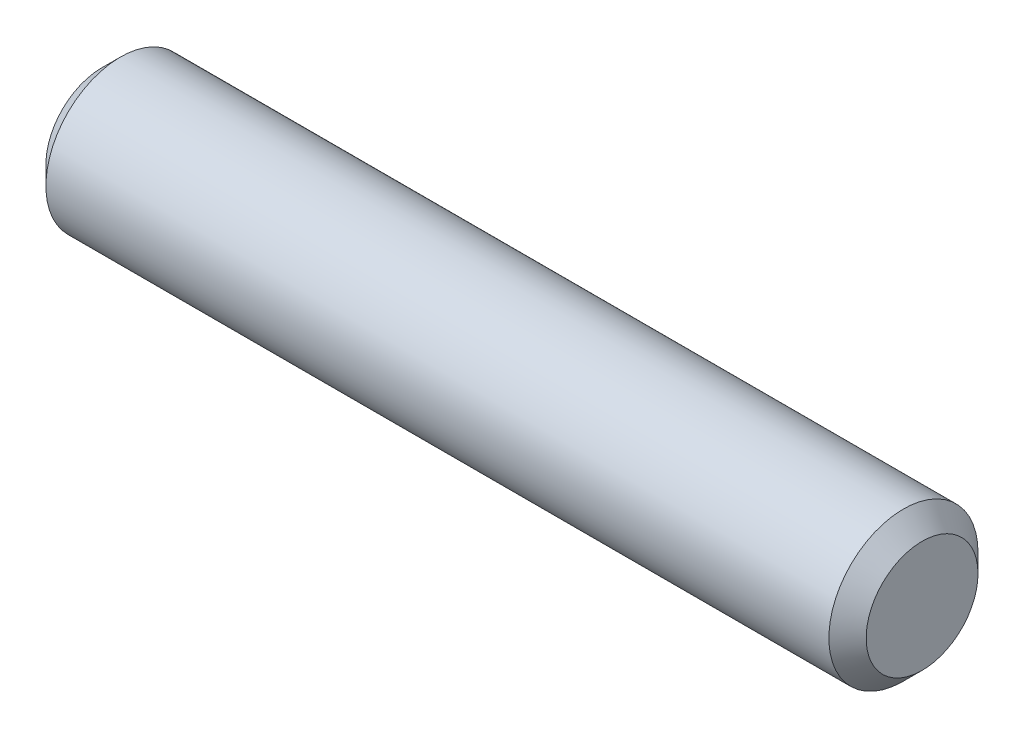
ISO-10303-21;
HEADER;
FILE_DESCRIPTION(('STEP AP214'),'2;1');
FILE_NAME('part.step','',(''),(''),'','','');
FILE_SCHEMA(('AUTOMOTIVE_DESIGN { 1 0 10303 214 1 1 1 1 }'));
ENDSEC;
DATA;
#1=APPLICATION_CONTEXT('core data for automotive mechanical design processes');
#2=APPLICATION_PROTOCOL_DEFINITION('international standard','automotive_design',2000,#1);
#3=PRODUCT_CONTEXT('',#1,'mechanical');
#4=PRODUCT('Part','Part','',(#3));
#5=PRODUCT_RELATED_PRODUCT_CATEGORY('part','',(#4));
#6=PRODUCT_DEFINITION_FORMATION('','',#4);
#7=PRODUCT_DEFINITION_CONTEXT('part definition',#1,'design');
#8=PRODUCT_DEFINITION('design','',#6,#7);
#9=PRODUCT_DEFINITION_SHAPE('','',#8);
#10=(LENGTH_UNIT() NAMED_UNIT(*) SI_UNIT(.MILLI.,.METRE.));
#11=(NAMED_UNIT(*) PLANE_ANGLE_UNIT() SI_UNIT($,.RADIAN.));
#12=(NAMED_UNIT(*) SI_UNIT($,.STERADIAN.) SOLID_ANGLE_UNIT());
#13=UNCERTAINTY_MEASURE_WITH_UNIT(LENGTH_MEASURE(1.E-05),#10,'distance_accuracy_value','');
#14=(GEOMETRIC_REPRESENTATION_CONTEXT(3) GLOBAL_UNCERTAINTY_ASSIGNED_CONTEXT((#13)) GLOBAL_UNIT_ASSIGNED_CONTEXT((#10,
#11,#12)) REPRESENTATION_CONTEXT('',''));
#15=CARTESIAN_POINT('',(0.,0.,0.));
#16=DIRECTION('',(0.,0.,1.));
#17=DIRECTION('',(1.,0.,0.));
#18=AXIS2_PLACEMENT_3D('',#15,#16,#17);
#19=CARTESIAN_POINT('',(22.,0.,0.));
#20=DIRECTION('',(-1.,0.,0.));
#21=DIRECTION('',(0.,0.,1.));
#22=AXIS2_PLACEMENT_3D('',#19,#20,#21);
#23=CYLINDRICAL_SURFACE('',#22,2.);
#24=CARTESIAN_POINT('',(0.5,0.,0.));
#25=DIRECTION('',(1.,0.,0.));
#26=DIRECTION('',(0.,0.,-1.));
#27=AXIS2_PLACEMENT_3D('',#24,#25,#26);
#28=CIRCLE('',#27,2.);
#29=CARTESIAN_POINT('',(0.5,0.,-2.));
#30=VERTEX_POINT('',#29);
#31=EDGE_CURVE('E55',#30,#30,#28,.T.);
#32=ORIENTED_EDGE('',*,*,#31,.T.);
#33=EDGE_LOOP('',(#32));
#34=FACE_BOUND('',#33,.T.);
#35=CARTESIAN_POINT('',(21.5,0.,0.));
#36=DIRECTION('',(1.,0.,0.));
#37=DIRECTION('',(0.,0.,-1.));
#38=AXIS2_PLACEMENT_3D('',#35,#36,#37);
#39=CIRCLE('',#38,2.);
#40=CARTESIAN_POINT('',(21.5,0.,-2.));
#41=VERTEX_POINT('',#40);
#42=EDGE_CURVE('E60',#41,#41,#39,.F.);
#43=ORIENTED_EDGE('',*,*,#42,.T.);
#44=EDGE_LOOP('',(#43));
#45=FACE_BOUND('',#44,.T.);
#46=ADVANCED_FACE('F41',(#34,#45),#23,.T.);
#47=CARTESIAN_POINT('',(22.,0.,0.));
#48=DIRECTION('',(1.,0.,0.));
#49=DIRECTION('',(0.,0.,-1.));
#50=AXIS2_PLACEMENT_3D('',#47,#48,#49);
#51=PLANE('',#50);
#52=CARTESIAN_POINT('',(22.,0.,0.));
#53=DIRECTION('',(1.,0.,0.));
#54=DIRECTION('',(0.,0.,-1.));
#55=AXIS2_PLACEMENT_3D('',#52,#53,#54);
#56=CIRCLE('',#55,1.5);
#57=CARTESIAN_POINT('',(22.,0.,-1.5));
#58=VERTEX_POINT('',#57);
#59=EDGE_CURVE('E10',#58,#58,#56,.T.);
#60=ORIENTED_EDGE('',*,*,#59,.T.);
#61=EDGE_LOOP('',(#60));
#62=FACE_BOUND('',#61,.T.);
#63=ADVANCED_FACE('F77',(#62),#51,.T.);
#64=CARTESIAN_POINT('',(0.,0.,0.));
#65=DIRECTION('',(1.,0.,0.));
#66=DIRECTION('',(0.,0.,-1.));
#67=AXIS2_PLACEMENT_3D('',#64,#65,#66);
#68=PLANE('',#67);
#69=CARTESIAN_POINT('',(0.,0.,0.));
#70=DIRECTION('',(1.,0.,0.));
#71=DIRECTION('',(0.,0.,-1.));
#72=AXIS2_PLACEMENT_3D('',#69,#70,#71);
#73=CIRCLE('',#72,1.5);
#74=CARTESIAN_POINT('',(0.,0.,-1.5));
#75=VERTEX_POINT('',#74);
#76=EDGE_CURVE('E50',#75,#75,#73,.F.);
#77=ORIENTED_EDGE('',*,*,#76,.T.);
#78=EDGE_LOOP('',(#77));
#79=FACE_BOUND('',#78,.T.);
#80=ADVANCED_FACE('F74',(#79),#68,.F.);
#81=CARTESIAN_POINT('',(0.5,0.,0.));
#82=DIRECTION('',(1.,0.,0.));
#83=DIRECTION('',(0.,0.,-1.));
#84=AXIS2_PLACEMENT_3D('',#81,#82,#83);
#85=CONICAL_SURFACE('',#84,2.,0.78539816339745);
#86=ORIENTED_EDGE('',*,*,#76,.F.);
#87=EDGE_LOOP('',(#86));
#88=FACE_BOUND('',#87,.T.);
#89=ORIENTED_EDGE('',*,*,#31,.F.);
#90=EDGE_LOOP('',(#89));
#91=FACE_BOUND('',#90,.T.);
#92=ADVANCED_FACE('F70',(#88,#91),#85,.T.);
#93=CARTESIAN_POINT('',(22.,0.,0.));
#94=DIRECTION('',(-1.,0.,0.));
#95=DIRECTION('',(0.,0.,1.));
#96=AXIS2_PLACEMENT_3D('',#93,#94,#95);
#97=CONICAL_SURFACE('',#96,1.5,0.785398163397447);
#98=ORIENTED_EDGE('',*,*,#42,.F.);
#99=EDGE_LOOP('',(#98));
#100=FACE_BOUND('',#99,.T.);
#101=ORIENTED_EDGE('',*,*,#59,.F.);
#102=EDGE_LOOP('',(#101));
#103=FACE_BOUND('',#102,.T.);
#104=ADVANCED_FACE('F44',(#100,#103),#97,.T.);
#105=CLOSED_SHELL('',(#46,#63,#80,#92,#104));
#106=MANIFOLD_SOLID_BREP('B2',#105);
#107=ADVANCED_BREP_SHAPE_REPRESENTATION('',(#18,#106),#14);
#108=SHAPE_DEFINITION_REPRESENTATION(#9,#107);
ENDSEC;
END-ISO-10303-21;
